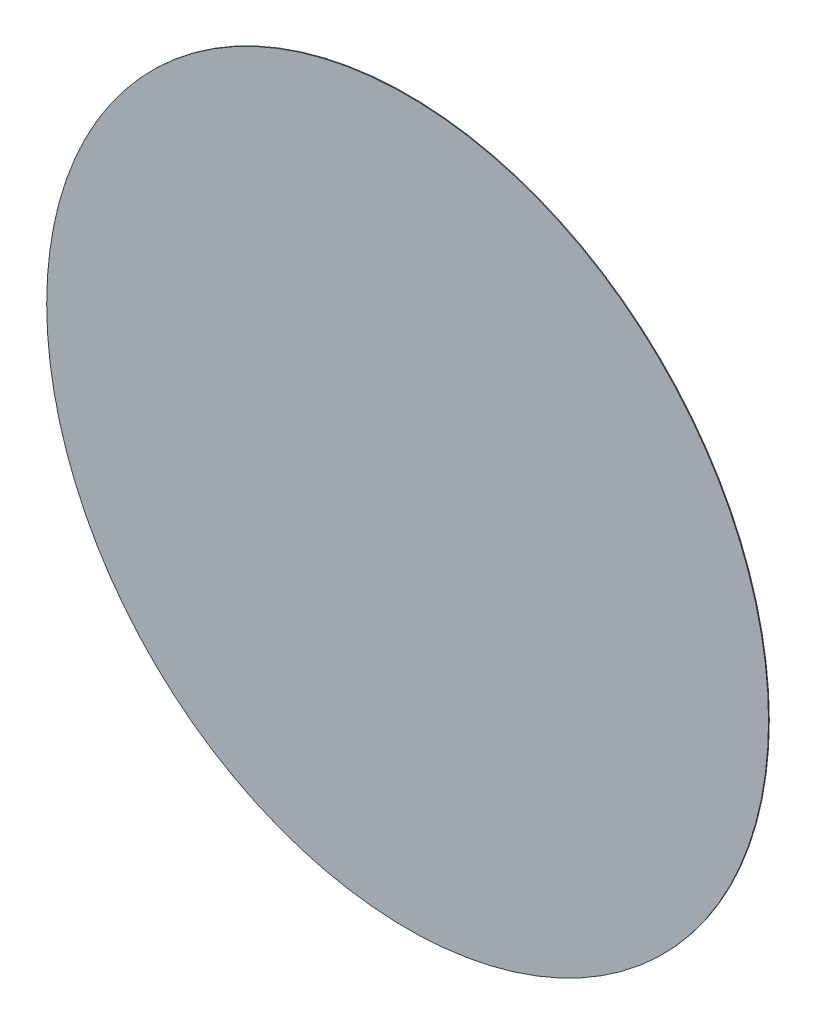
ISO-10303-21;
HEADER;
FILE_DESCRIPTION(('STEP AP214'),'2;1');
FILE_NAME('part.step','',(''),(''),'','','');
FILE_SCHEMA(('AUTOMOTIVE_DESIGN { 1 0 10303 214 1 1 1 1 }'));
ENDSEC;
DATA;
#1=APPLICATION_CONTEXT('core data for automotive mechanical design processes');
#2=APPLICATION_PROTOCOL_DEFINITION('international standard','automotive_design',2000,#1);
#3=PRODUCT_CONTEXT('',#1,'mechanical');
#4=PRODUCT('Part','Part','',(#3));
#5=PRODUCT_RELATED_PRODUCT_CATEGORY('part','',(#4));
#6=PRODUCT_DEFINITION_FORMATION('','',#4);
#7=PRODUCT_DEFINITION_CONTEXT('part definition',#1,'design');
#8=PRODUCT_DEFINITION('design','',#6,#7);
#9=PRODUCT_DEFINITION_SHAPE('','',#8);
#10=(LENGTH_UNIT() NAMED_UNIT(*) SI_UNIT(.MILLI.,.METRE.));
#11=(NAMED_UNIT(*) PLANE_ANGLE_UNIT() SI_UNIT($,.RADIAN.));
#12=(NAMED_UNIT(*) SI_UNIT($,.STERADIAN.) SOLID_ANGLE_UNIT());
#13=UNCERTAINTY_MEASURE_WITH_UNIT(LENGTH_MEASURE(1.E-05),#10,'distance_accuracy_value','');
#14=(GEOMETRIC_REPRESENTATION_CONTEXT(3) GLOBAL_UNCERTAINTY_ASSIGNED_CONTEXT((#13)) GLOBAL_UNIT_ASSIGNED_CONTEXT((#10,
#11,#12)) REPRESENTATION_CONTEXT('',''));
#15=CARTESIAN_POINT('',(0.,0.,0.));
#16=DIRECTION('',(0.,0.,1.));
#17=DIRECTION('',(1.,0.,0.));
#18=AXIS2_PLACEMENT_3D('',#15,#16,#17);
#19=CARTESIAN_POINT('',(0.,0.,0.01));
#20=DIRECTION('',(0.,0.,-1.));
#21=DIRECTION('',(-1.,0.,0.));
#22=AXIS2_PLACEMENT_3D('',#19,#20,#21);
#23=CYLINDRICAL_SURFACE('',#22,4.75);
#24=CARTESIAN_POINT('',(0.,0.,0.01));
#25=DIRECTION('',(0.,0.,1.));
#26=DIRECTION('',(1.,0.,0.));
#27=AXIS2_PLACEMENT_3D('',#24,#25,#26);
#28=CIRCLE('',#27,4.75);
#29=CARTESIAN_POINT('',(4.75,0.,0.01));
#30=VERTEX_POINT('',#29);
#31=EDGE_CURVE('E10',#30,#30,#28,.T.);
#32=ORIENTED_EDGE('',*,*,#31,.F.);
#33=EDGE_LOOP('',(#32));
#34=FACE_BOUND('',#33,.T.);
#35=CARTESIAN_POINT('',(0.,0.,0.));
#36=DIRECTION('',(0.,0.,1.));
#37=DIRECTION('',(1.,0.,0.));
#38=AXIS2_PLACEMENT_3D('',#35,#36,#37);
#39=CIRCLE('',#38,4.75);
#40=CARTESIAN_POINT('',(4.75,0.,0.));
#41=VERTEX_POINT('',#40);
#42=EDGE_CURVE('E35',#41,#41,#39,.T.);
#43=ORIENTED_EDGE('',*,*,#42,.T.);
#44=EDGE_LOOP('',(#43));
#45=FACE_BOUND('',#44,.T.);
#46=ADVANCED_FACE('F32',(#34,#45),#23,.T.);
#47=CARTESIAN_POINT('',(0.,0.,0.01));
#48=DIRECTION('',(0.,0.,1.));
#49=DIRECTION('',(1.,0.,0.));
#50=AXIS2_PLACEMENT_3D('',#47,#48,#49);
#51=PLANE('',#50);
#52=ORIENTED_EDGE('',*,*,#31,.T.);
#53=EDGE_LOOP('',(#52));
#54=FACE_BOUND('',#53,.T.);
#55=ADVANCED_FACE('F47',(#54),#51,.T.);
#56=CARTESIAN_POINT('',(0.,0.,0.));
#57=DIRECTION('',(0.,0.,1.));
#58=DIRECTION('',(1.,0.,0.));
#59=AXIS2_PLACEMENT_3D('',#56,#57,#58);
#60=PLANE('',#59);
#61=ORIENTED_EDGE('',*,*,#42,.F.);
#62=EDGE_LOOP('',(#61));
#63=FACE_BOUND('',#62,.T.);
#64=ADVANCED_FACE('F45',(#63),#60,.F.);
#65=CLOSED_SHELL('',(#46,#55,#64));
#66=MANIFOLD_SOLID_BREP('B2',#65);
#67=ADVANCED_BREP_SHAPE_REPRESENTATION('',(#18,#66),#14);
#68=SHAPE_DEFINITION_REPRESENTATION(#9,#67);
ENDSEC;
END-ISO-10303-21;
